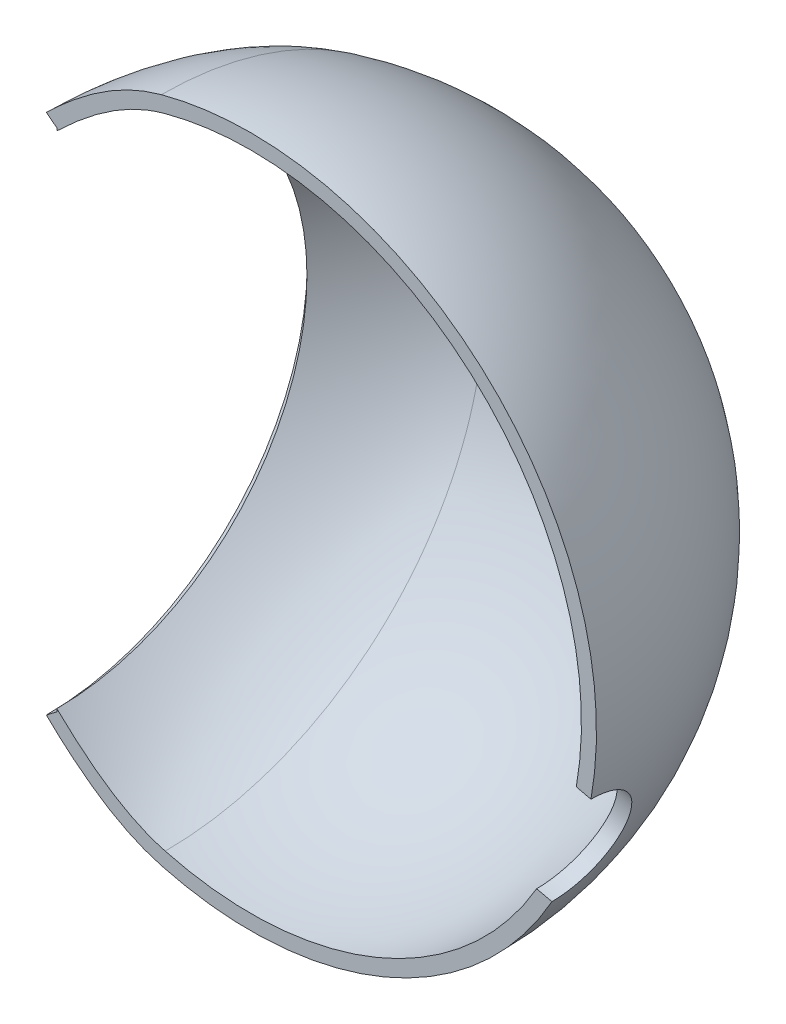
ISO-10303-21;
HEADER;
FILE_DESCRIPTION(('STEP AP214'),'2;1');
FILE_NAME('part.step','',(''),(''),'','','');
FILE_SCHEMA(('AUTOMOTIVE_DESIGN { 1 0 10303 214 1 1 1 1 }'));
ENDSEC;
DATA;
#1=APPLICATION_CONTEXT('core data for automotive mechanical design processes');
#2=APPLICATION_PROTOCOL_DEFINITION('international standard','automotive_design',2000,#1);
#3=PRODUCT_CONTEXT('',#1,'mechanical');
#4=PRODUCT('Part','Part','',(#3));
#5=PRODUCT_RELATED_PRODUCT_CATEGORY('part','',(#4));
#6=PRODUCT_DEFINITION_FORMATION('','',#4);
#7=PRODUCT_DEFINITION_CONTEXT('part definition',#1,'design');
#8=PRODUCT_DEFINITION('design','',#6,#7);
#9=PRODUCT_DEFINITION_SHAPE('','',#8);
#10=(LENGTH_UNIT() NAMED_UNIT(*) SI_UNIT(.MILLI.,.METRE.));
#11=(NAMED_UNIT(*) PLANE_ANGLE_UNIT() SI_UNIT($,.RADIAN.));
#12=(NAMED_UNIT(*) SI_UNIT($,.STERADIAN.) SOLID_ANGLE_UNIT());
#13=UNCERTAINTY_MEASURE_WITH_UNIT(LENGTH_MEASURE(1.E-05),#10,'distance_accuracy_value','');
#14=(GEOMETRIC_REPRESENTATION_CONTEXT(3) GLOBAL_UNCERTAINTY_ASSIGNED_CONTEXT((#13)) GLOBAL_UNIT_ASSIGNED_CONTEXT((#10,
#11,#12)) REPRESENTATION_CONTEXT('',''));
#15=CARTESIAN_POINT('',(0.,0.,0.));
#16=DIRECTION('',(0.,0.,1.));
#17=DIRECTION('',(1.,0.,0.));
#18=AXIS2_PLACEMENT_3D('',#15,#16,#17);
#19=CARTESIAN_POINT('',(-6.80370320936501,0.,0.));
#20=DIRECTION('',(-1.,0.,0.));
#21=DIRECTION('',(0.,0.,1.));
#22=AXIS2_PLACEMENT_3D('',#19,#20,#21);
#23=CONICAL_SURFACE('',#22,8.68183081701681,0.65462054811976);
#24=DIRECTION('',(0.793279017623361,0.608858275954688,0.));
#25=VECTOR('',#24,1.);
#26=CARTESIAN_POINT('',(4.50781951059202,0.,0.));
#27=LINE('',#26,#25);
#28=CARTESIAN_POINT('',(-6.45373387807853,-8.41322201866174,0.));
#29=VERTEX_POINT('',#28);
#30=CARTESIAN_POINT('',(-6.80370320936501,-8.68183081701681,0.));
#31=VERTEX_POINT('',#30);
#32=EDGE_CURVE('E178',#29,#31,#27,.F.);
#33=ORIENTED_EDGE('',*,*,#32,.F.);
#34=CARTESIAN_POINT('',(-6.45373387807853,0.,0.));
#35=DIRECTION('',(-1.,0.,0.));
#36=DIRECTION('',(0.,0.,1.));
#37=AXIS2_PLACEMENT_3D('',#34,#35,#36);
#38=CIRCLE('',#37,8.41322201866174);
#39=CARTESIAN_POINT('',(-6.45373387807853,0.,-8.41322201866174));
#40=VERTEX_POINT('',#39);
#41=EDGE_CURVE('E175',#40,#29,#38,.T.);
#42=ORIENTED_EDGE('',*,*,#41,.F.);
#43=DIRECTION('',(-0.793279017623361,0.,-0.608858275954688));
#44=VECTOR('',#43,1.);
#45=CARTESIAN_POINT('',(-6.80370320936501,0.,-8.68183081701681));
#46=LINE('',#45,#44);
#47=CARTESIAN_POINT('',(-6.80370320936501,0.,-8.68183081701681));
#48=VERTEX_POINT('',#47);
#49=EDGE_CURVE('E187',#40,#48,#46,.T.);
#50=ORIENTED_EDGE('',*,*,#49,.T.);
#51=CARTESIAN_POINT('',(-6.80370320936501,0.,0.));
#52=DIRECTION('',(-1.,0.,0.));
#53=DIRECTION('',(0.,0.,1.));
#54=AXIS2_PLACEMENT_3D('',#51,#52,#53);
#55=CIRCLE('',#54,8.68183081701681);
#56=EDGE_CURVE('E267',#48,#31,#55,.T.);
#57=ORIENTED_EDGE('',*,*,#56,.T.);
#58=EDGE_LOOP('',(#33,#42,#50,#57));
#59=FACE_BOUND('',#58,.T.);
#60=ADVANCED_FACE('F46',(#59),#23,.F.);
#61=CARTESIAN_POINT('',(-6.45373387807853,0.,0.));
#62=DIRECTION('',(1.,0.,0.));
#63=DIRECTION('',(0.,0.,-1.));
#64=AXIS2_PLACEMENT_3D('',#61,#62,#63);
#65=CONICAL_SURFACE('',#64,8.41322201866174,1.5512061202161);
#66=CARTESIAN_POINT('',(-6.45550146267924,0.,0.));
#67=DIRECTION('',(-1.,0.,0.));
#68=DIRECTION('',(0.,0.,1.));
#69=AXIS2_PLACEMENT_3D('',#66,#67,#68);
#70=CIRCLE('',#69,8.32300558991455);
#71=CARTESIAN_POINT('',(-6.45550146267924,8.32300558991455,0.));
#72=VERTEX_POINT('',#71);
#73=CARTESIAN_POINT('',(-6.45550146267924,0.,-8.32300558991455));
#74=VERTEX_POINT('',#73);
#75=EDGE_CURVE('E265',#72,#74,#70,.T.);
#76=ORIENTED_EDGE('',*,*,#75,.F.);
#77=DIRECTION('',(-0.0195889535603576,-0.999808118039862,0.));
#78=VECTOR('',#77,1.);
#79=CARTESIAN_POINT('',(-6.61857172290384,0.,0.));
#80=LINE('',#79,#78);
#81=CARTESIAN_POINT('',(-6.45373387807853,8.41322201866174,0.));
#82=VERTEX_POINT('',#81);
#83=EDGE_CURVE('E64',#72,#82,#80,.F.);
#84=ORIENTED_EDGE('',*,*,#83,.T.);
#85=CARTESIAN_POINT('',(-6.45373387807853,0.,0.));
#86=DIRECTION('',(-1.,0.,0.));
#87=DIRECTION('',(0.,0.,1.));
#88=AXIS2_PLACEMENT_3D('',#85,#86,#87);
#89=CIRCLE('',#88,8.41322201866174);
#90=EDGE_CURVE('E192',#82,#40,#89,.T.);
#91=ORIENTED_EDGE('',*,*,#90,.T.);
#92=DIRECTION('',(0.0195889535603576,0.,-0.999808118039862));
#93=VECTOR('',#92,1.);
#94=CARTESIAN_POINT('',(-6.45373387807853,0.,-8.41322201866174));
#95=LINE('',#94,#93);
#96=EDGE_CURVE('E272',#74,#40,#95,.T.);
#97=ORIENTED_EDGE('',*,*,#96,.F.);
#98=EDGE_LOOP('',(#76,#84,#91,#97));
#99=FACE_BOUND('',#98,.T.);
#100=ADVANCED_FACE('F207',(#99),#65,.T.);
#101=CARTESIAN_POINT('',(-6.45373387807853,0.,0.));
#102=DIRECTION('',(1.,0.,0.));
#103=DIRECTION('',(0.,0.,-1.));
#104=AXIS2_PLACEMENT_3D('',#101,#102,#103);
#105=CONICAL_SURFACE('',#104,8.41322201866174,1.5512061202161);
#106=ORIENTED_EDGE('',*,*,#41,.T.);
#107=DIRECTION('',(0.0195889535603576,-0.999808118039862,0.));
#108=VECTOR('',#107,1.);
#109=CARTESIAN_POINT('',(-6.61857172290384,0.,0.));
#110=LINE('',#109,#108);
#111=CARTESIAN_POINT('',(-6.45550146267924,-8.32300558991447,0.));
#112=VERTEX_POINT('',#111);
#113=EDGE_CURVE('E170',#29,#112,#110,.F.);
#114=ORIENTED_EDGE('',*,*,#113,.T.);
#115=CARTESIAN_POINT('',(-6.45550146267924,0.,0.));
#116=DIRECTION('',(-1.,0.,0.));
#117=DIRECTION('',(0.,0.,1.));
#118=AXIS2_PLACEMENT_3D('',#115,#116,#117);
#119=CIRCLE('',#118,8.32300558991455);
#120=EDGE_CURVE('E11',#74,#112,#119,.T.);
#121=ORIENTED_EDGE('',*,*,#120,.F.);
#122=ORIENTED_EDGE('',*,*,#96,.T.);
#123=EDGE_LOOP('',(#106,#114,#121,#122));
#124=FACE_BOUND('',#123,.T.);
#125=ADVANCED_FACE('F215',(#124),#105,.T.);
#126=CARTESIAN_POINT('',(-6.80370320936501,0.,0.));
#127=DIRECTION('',(-1.,0.,0.));
#128=DIRECTION('',(0.,0.,1.));
#129=AXIS2_PLACEMENT_3D('',#126,#127,#128);
#130=CONICAL_SURFACE('',#129,8.68183081701681,0.65462054811976);
#131=DIRECTION('',(-0.793279017623361,0.608858275954688,0.));
#132=VECTOR('',#131,1.);
#133=CARTESIAN_POINT('',(4.50781951059202,0.,0.));
#134=LINE('',#133,#132);
#135=CARTESIAN_POINT('',(-6.80370320936501,8.68183081701681,0.));
#136=VERTEX_POINT('',#135);
#137=EDGE_CURVE('E100',#136,#82,#134,.F.);
#138=ORIENTED_EDGE('',*,*,#137,.F.);
#139=CARTESIAN_POINT('',(-6.80370320936501,0.,0.));
#140=DIRECTION('',(-1.,0.,0.));
#141=DIRECTION('',(0.,0.,1.));
#142=AXIS2_PLACEMENT_3D('',#139,#140,#141);
#143=CIRCLE('',#142,8.68183081701681);
#144=EDGE_CURVE('E90',#136,#48,#143,.T.);
#145=ORIENTED_EDGE('',*,*,#144,.T.);
#146=ORIENTED_EDGE('',*,*,#49,.F.);
#147=ORIENTED_EDGE('',*,*,#90,.F.);
#148=EDGE_LOOP('',(#138,#145,#146,#147));
#149=FACE_BOUND('',#148,.T.);
#150=ADVANCED_FACE('F48',(#149),#130,.F.);
#151=CARTESIAN_POINT('',(-6.45550146267924,8.32300558991455,0.));
#152=CARTESIAN_POINT('',(-6.45550146267924,8.32300558991455,-16.6460111798291));
#153=CARTESIAN_POINT('',(-6.45550146267924,-8.32300558991455,-16.6460111798291));
#154=CARTESIAN_POINT('',(-6.45550146267924,-8.32300558991455,0.));
#155=CARTESIAN_POINT('',(-5.91999017324329,8.84266238176662,0.));
#156=CARTESIAN_POINT('',(-5.91999017324329,8.84266238176661,-17.6853247635332));
#157=CARTESIAN_POINT('',(-5.91999017324329,-8.84266238176661,-17.6853247635332));
#158=CARTESIAN_POINT('',(-5.91999017324329,-8.84266238176662,0.));
#159=CARTESIAN_POINT('',(-4.73611037690482,9.84639633856675,0.));
#160=CARTESIAN_POINT('',(-4.73611037690482,9.84639633856675,-19.6927926771335));
#161=CARTESIAN_POINT('',(-4.73611037690482,-9.84639633856675,-19.6927926771335));
#162=CARTESIAN_POINT('',(-4.73611037690482,-9.84639633856675,0.));
#163=CARTESIAN_POINT('',(-3.51528645360956,10.4461198181058,0.));
#164=CARTESIAN_POINT('',(-3.51528645360956,10.4461198181058,-20.8922396362115));
#165=CARTESIAN_POINT('',(-3.51528645360956,-10.4461198181058,-20.8922396362115));
#166=CARTESIAN_POINT('',(-3.51528645360956,-10.4461198181058,0.));
#167=CARTESIAN_POINT('',(-2.84700949613016,10.6251840891791,0.));
#168=CARTESIAN_POINT('',(-2.84700949613016,10.6251840891791,-21.2503681783582));
#169=CARTESIAN_POINT('',(-2.84700949613016,-10.6251840891791,-21.2503681783582));
#170=CARTESIAN_POINT('',(-2.84700949613016,-10.6251840891791,0.));
#171=(BOUNDED_SURFACE() B_SPLINE_SURFACE(3,3,((#151,#152,#153,#154),(#155,#156,#157,#158),(#159,
#160,#161,#162),(#163,#164,#165,#166),(#167,#168,#169,#170)),.UNSPECIFIED.,.F.,.F.,
.F.) B_SPLINE_SURFACE_WITH_KNOTS((4,1,4),(4,4),(0.,0.136304271179648,0.272608542359295),(0.,1.),
.UNSPECIFIED.) GEOMETRIC_REPRESENTATION_ITEM() RATIONAL_B_SPLINE_SURFACE(((1.,0.333333333333334,
0.333333333333334,1.),(1.,0.333333333333334,0.333333333333334,1.),(1.,0.333333333333334,
0.333333333333334,1.),(1.,0.333333333333334,0.333333333333334,1.),(1.,0.333333333333334,
0.333333333333334,1.))) REPRESENTATION_ITEM('') SURFACE());
#172=CARTESIAN_POINT('',(-6.45550146267924,-8.32300558991455,0.));
#173=CARTESIAN_POINT('',(-5.91999017324329,-8.84266238176662,0.));
#174=CARTESIAN_POINT('',(-4.73611037690482,-9.84639633856675,0.));
#175=CARTESIAN_POINT('',(-3.51528645360956,-10.4461198181058,0.));
#176=CARTESIAN_POINT('',(-2.84700949613016,-10.6251840891791,0.));
#177=(BOUNDED_CURVE() B_SPLINE_CURVE(3,(#172,#173,#174,#175,#176),.UNSPECIFIED.,.F.,
.F.) B_SPLINE_CURVE_WITH_KNOTS((4,1,4),(0.,0.136304271179648,0.272608542359295),
.UNSPECIFIED.) CURVE() GEOMETRIC_REPRESENTATION_ITEM() RATIONAL_B_SPLINE_CURVE((1.,1.,1.,1.,1.)) REPRESENTATION_ITEM(''));
#178=CARTESIAN_POINT('',(-2.84700949613016,-10.6251840891791,0.));
#179=VERTEX_POINT('',#178);
#180=EDGE_CURVE('E56',#112,#179,#177,.T.);
#181=CARTESIAN_POINT('',(-2.84700949613016,0.,0.));
#182=DIRECTION('',(-1.,0.,0.));
#183=DIRECTION('',(0.,0.,1.));
#184=AXIS2_PLACEMENT_3D('',#181,#182,#183);
#185=CIRCLE('',#184,10.6251840891791);
#186=CARTESIAN_POINT('',(-2.84700949613016,10.6251840891791,0.));
#187=VERTEX_POINT('',#186);
#188=EDGE_CURVE('E77',#187,#179,#185,.T.);
#189=CARTESIAN_POINT('',(-6.45550146267924,8.32300558991455,0.));
#190=CARTESIAN_POINT('',(-5.91999017324329,8.84266238176662,0.));
#191=CARTESIAN_POINT('',(-4.73611037690482,9.84639633856675,0.));
#192=CARTESIAN_POINT('',(-3.51528645360956,10.4461198181058,0.));
#193=CARTESIAN_POINT('',(-2.84700949613016,10.6251840891791,0.));
#194=(BOUNDED_CURVE() B_SPLINE_CURVE(3,(#189,#190,#191,#192,#193),.UNSPECIFIED.,.F.,
.F.) B_SPLINE_CURVE_WITH_KNOTS((4,1,4),(0.,0.136304271179648,0.272608542359295),
.UNSPECIFIED.) CURVE() GEOMETRIC_REPRESENTATION_ITEM() RATIONAL_B_SPLINE_CURVE((1.,1.,1.,1.,1.)) REPRESENTATION_ITEM(''));
#195=EDGE_CURVE('E252',#72,#187,#194,.T.);
#196=ORIENTED_EDGE('',*,*,#120,.T.);
#197=ORIENTED_EDGE('',*,*,#180,.T.);
#198=ORIENTED_EDGE('',*,*,#188,.F.);
#199=ORIENTED_EDGE('',*,*,#195,.F.);
#200=ORIENTED_EDGE('',*,*,#75,.T.);
#201=EDGE_LOOP('',(#196,#197,#198,#199,#200));
#202=FACE_BOUND('',#201,.T.);
#203=ADVANCED_FACE('F209',(#202),#171,.F.);
#204=CARTESIAN_POINT('',(-2.976419018679,11.1081470023243,0.));
#205=CARTESIAN_POINT('',(-2.97641901867899,11.1081470023243,-22.2162940046486));
#206=CARTESIAN_POINT('',(-2.97641901867899,-11.1081470023243,-22.2162940046486));
#207=CARTESIAN_POINT('',(-2.976419018679,-11.1081470023243,0.));
#208=CARTESIAN_POINT('',(-3.63608081291208,10.9313911572854,0.));
#209=CARTESIAN_POINT('',(-3.63608081291208,10.9313911572854,-21.8627823145708));
#210=CARTESIAN_POINT('',(-3.63608081291208,-10.9313911572854,-21.8627823145708));
#211=CARTESIAN_POINT('',(-3.63608081291208,-10.9313911572854,0.));
#212=CARTESIAN_POINT('',(-4.87193740120474,10.3462670900726,0.));
#213=CARTESIAN_POINT('',(-4.87193740120474,10.3462670900726,-20.6925341801452));
#214=CARTESIAN_POINT('',(-4.87193740120474,-10.3462670900726,-20.6925341801452));
#215=CARTESIAN_POINT('',(-4.87193740120474,-10.3462670900726,0.));
#216=CARTESIAN_POINT('',(-6.09705889057331,9.35541284183251,0.));
#217=CARTESIAN_POINT('',(-6.0970588905733,9.35541284183251,-18.710825683665));
#218=CARTESIAN_POINT('',(-6.0970588905733,-9.35541284183251,-18.710825683665));
#219=CARTESIAN_POINT('',(-6.09705889057331,-9.35541284183251,0.));
#220=CARTESIAN_POINT('',(-6.71088845271634,8.77189767392169,0.));
#221=CARTESIAN_POINT('',(-6.71088845271634,8.77189767392169,-17.5437953478434));
#222=CARTESIAN_POINT('',(-6.71088845271634,-8.77189767392169,-17.5437953478434));
#223=CARTESIAN_POINT('',(-6.71088845271634,-8.77189767392169,0.));
#224=CARTESIAN_POINT('',(-6.80370320936501,8.68183081701681,0.));
#225=CARTESIAN_POINT('',(-6.803703209365,8.6818308170168,-17.3636616340336));
#226=CARTESIAN_POINT('',(-6.803703209365,-8.6818308170168,-17.3636616340336));
#227=CARTESIAN_POINT('',(-6.80370320936501,-8.68183081701681,0.));
#228=(BOUNDED_SURFACE() B_SPLINE_SURFACE(3,3,((#204,#205,#206,#207),(#208,#209,#210,#211),(#212,
#213,#214,#215),(#216,#217,#218,#219),(#220,#221,#222,#223),(#224,#225,#226,#227)),
.UNSPECIFIED.,.F.,.F.,.F.) B_SPLINE_SURFACE_WITH_KNOTS((4,1,1,4),(4,4),(0.,0.125,0.25,
0.272608542359295),(0.,1.),
.UNSPECIFIED.) GEOMETRIC_REPRESENTATION_ITEM() RATIONAL_B_SPLINE_SURFACE(((1.,0.333333333333334,
0.333333333333334,1.),(1.,0.333333333333334,0.333333333333334,1.),(1.,0.333333333333334,
0.333333333333334,1.),(1.,0.333333333333334,0.333333333333334,1.),(1.,0.333333333333334,
0.333333333333334,1.),(1.,0.333333333333334,0.333333333333334,1.))) REPRESENTATION_ITEM('') SURFACE());
#229=CARTESIAN_POINT('',(-2.976419018679,0.,0.));
#230=DIRECTION('',(-1.,0.,0.));
#231=DIRECTION('',(0.,0.,1.));
#232=AXIS2_PLACEMENT_3D('',#229,#230,#231);
#233=CIRCLE('',#232,11.1081470023243);
#234=CARTESIAN_POINT('',(-2.976419018679,11.1081470023243,0.));
#235=VERTEX_POINT('',#234);
#236=CARTESIAN_POINT('',(-2.976419018679,-11.1081470023243,0.));
#237=VERTEX_POINT('',#236);
#238=EDGE_CURVE('E147',#235,#237,#233,.T.);
#239=CARTESIAN_POINT('',(-2.976419018679,-11.1081470023243,0.));
#240=CARTESIAN_POINT('',(-3.63608081291208,-10.9313911572854,0.));
#241=CARTESIAN_POINT('',(-4.87193740120474,-10.3462670900726,0.));
#242=CARTESIAN_POINT('',(-6.09705889057331,-9.35541284183251,0.));
#243=CARTESIAN_POINT('',(-6.71088845271634,-8.77189767392169,0.));
#244=CARTESIAN_POINT('',(-6.80370320936501,-8.68183081701681,0.));
#245=(BOUNDED_CURVE() B_SPLINE_CURVE(3,(#239,#240,#241,#242,#243,#244),.UNSPECIFIED.,.F.,
.F.) B_SPLINE_CURVE_WITH_KNOTS((4,1,1,4),(0.,0.125,0.25,0.272608542359295),
.UNSPECIFIED.) CURVE() GEOMETRIC_REPRESENTATION_ITEM() RATIONAL_B_SPLINE_CURVE((1.,1.,1.,1.,1.,1.)) REPRESENTATION_ITEM(''));
#246=EDGE_CURVE('E186',#237,#31,#245,.T.);
#247=CARTESIAN_POINT('',(-2.976419018679,11.1081470023243,0.));
#248=CARTESIAN_POINT('',(-3.63608081291208,10.9313911572854,0.));
#249=CARTESIAN_POINT('',(-4.87193740120474,10.3462670900726,0.));
#250=CARTESIAN_POINT('',(-6.09705889057331,9.35541284183251,0.));
#251=CARTESIAN_POINT('',(-6.71088845271634,8.77189767392169,0.));
#252=CARTESIAN_POINT('',(-6.80370320936501,8.68183081701681,0.));
#253=(BOUNDED_CURVE() B_SPLINE_CURVE(3,(#247,#248,#249,#250,#251,#252),.UNSPECIFIED.,.F.,
.F.) B_SPLINE_CURVE_WITH_KNOTS((4,1,1,4),(0.,0.125,0.25,0.272608542359295),
.UNSPECIFIED.) CURVE() GEOMETRIC_REPRESENTATION_ITEM() RATIONAL_B_SPLINE_CURVE((1.,1.,1.,1.,1.,1.)) REPRESENTATION_ITEM(''));
#254=EDGE_CURVE('E152',#235,#136,#253,.T.);
#255=ORIENTED_EDGE('',*,*,#238,.T.);
#256=ORIENTED_EDGE('',*,*,#246,.T.);
#257=ORIENTED_EDGE('',*,*,#56,.F.);
#258=ORIENTED_EDGE('',*,*,#144,.F.);
#259=ORIENTED_EDGE('',*,*,#254,.F.);
#260=EDGE_LOOP('',(#255,#256,#257,#258,#259));
#261=FACE_BOUND('',#260,.T.);
#262=ADVANCED_FACE('F214',(#261),#228,.F.);
#263=CARTESIAN_POINT('',(6.01695143432406,-2.77433184048614,0.));
#264=DIRECTION('',(0.974370064785235,-0.224951054343866,0.));
#265=DIRECTION('',(0.224951054343866,0.974370064785235,0.));
#266=AXIS2_PLACEMENT_3D('',#263,#264,#265);
#267=CYLINDRICAL_SURFACE('',#266,1.9);
#268=CARTESIAN_POINT('',(9.5086453426254,-5.53043070186837,-2.22369066106711E-13));
#269=CARTESIAN_POINT('',(9.50864462524465,-5.53043209028466,-0.0280510965341373));
#270=CARTESIAN_POINT('',(9.50885076183308,-5.52986409921521,-0.0561032733702905));
#271=CARTESIAN_POINT('',(9.50968434170283,-5.52758030343548,-0.111961716646305));
#272=CARTESIAN_POINT('',(9.51030888686742,-5.52587239469394,-0.139768350479469));
#273=CARTESIAN_POINT('',(9.51198239472775,-5.5213116151555,-0.195134425242829));
#274=CARTESIAN_POINT('',(9.51302921039203,-5.51846453704189,-0.222694406289802));
#275=CARTESIAN_POINT('',(9.51554799153365,-5.51163019427974,-0.277565422337399));
#276=CARTESIAN_POINT('',(9.51701861613647,-5.5076465260395,-0.304876966519076));
#277=CARTESIAN_POINT('',(9.52038475708987,-5.4985430240805,-0.359249823317197));
#278=CARTESIAN_POINT('',(9.52227976063192,-5.49342456169164,-0.386311397236591));
#279=CARTESIAN_POINT('',(9.52649310346573,-5.48205532578591,-0.440183377090189));
#280=CARTESIAN_POINT('',(9.52881175448377,-5.47580371851091,-0.466993582690472));
#281=CARTESIAN_POINT('',(9.53386959618845,-5.46217182843259,-0.520361805616304));
#282=CARTESIAN_POINT('',(9.53660989269636,-5.45478857794817,-0.54691895894667));
#283=CARTESIAN_POINT('',(9.54250726944915,-5.43889609383545,-0.59978178675983));
#284=CARTESIAN_POINT('',(9.54566619518155,-5.43038187402177,-0.626085759842199));
#285=CARTESIAN_POINT('',(9.55070455500348,-5.41679184852819,-0.665284823321979));
#286=CARTESIAN_POINT('',(9.55243834095331,-5.41211367639078,-0.678338097008748));
#287=CARTESIAN_POINT('',(9.55600831187515,-5.40247614277646,-0.70438152809006));
#288=CARTESIAN_POINT('',(9.55784484696714,-5.39751581876463,-0.71737128215711));
#289=CARTESIAN_POINT('',(9.56161611503238,-5.38732361659691,-0.743262442280261));
#290=CARTESIAN_POINT('',(9.563551051521,-5.3820911750921,-0.756163596937283));
#291=CARTESIAN_POINT('',(9.56750854865855,-5.37138517701149,-0.781791188486794));
#292=CARTESIAN_POINT('',(9.56953073672508,-5.36591264426129,-0.794518111571913));
#293=CARTESIAN_POINT('',(9.57571942166336,-5.34916090249019,-0.832376854290959));
#294=CARTESIAN_POINT('',(9.58002696945975,-5.33749635707117,-0.857316770525563));
#295=CARTESIAN_POINT('',(9.58899670116071,-5.31320763737066,-0.906496132680604));
#296=CARTESIAN_POINT('',(9.59365695954915,-5.3005886736692,-0.930738507716759));
#297=CARTESIAN_POINT('',(9.6033323834999,-5.27439661434628,-0.978524787225851));
#298=CARTESIAN_POINT('',(9.60834634935208,-5.26082674497341,-1.00207070150676));
#299=CARTESIAN_POINT('',(9.61872818560994,-5.23273835377446,-1.04846492283434));
#300=CARTESIAN_POINT('',(9.62409557329063,-5.2182211261407,-1.07131412151436));
#301=CARTESIAN_POINT('',(9.63518225209111,-5.1882427254469,-1.11631650329632));
#302=CARTESIAN_POINT('',(9.64090174469525,-5.17278101196539,-1.13846927672405));
#303=CARTESIAN_POINT('',(9.65268959138925,-5.14091772795332,-1.18208058550522));
#304=CARTESIAN_POINT('',(9.65875877698731,-5.12451391760916,-1.20353725911318));
#305=CARTESIAN_POINT('',(9.67124200635601,-5.09076974889152,-1.24575842402452));
#306=CARTESIAN_POINT('',(9.67765743869136,-5.07342561803117,-1.2665194884583));
#307=CARTESIAN_POINT('',(9.69082808357121,-5.0378035786103,-1.30735166927316));
#308=CARTESIAN_POINT('',(9.69758515275847,-5.01952055668609,-1.32741772223807));
#309=CARTESIAN_POINT('',(9.71139302690518,-4.98213137427579,-1.36674720898345));
#310=CARTESIAN_POINT('',(9.71844441494882,-4.96302357697111,-1.38600888200589));
#311=CARTESIAN_POINT('',(9.73277663417175,-4.92417185753104,-1.42350462997387));
#312=CARTESIAN_POINT('',(9.7400555992571,-4.90443308902441,-1.44174475430843));
#313=CARTESIAN_POINT('',(9.7548448843738,-4.86432401433446,-1.47720022762995));
#314=CARTESIAN_POINT('',(9.76235389282675,-4.84395728525671,-1.49442016893013));
#315=CARTESIAN_POINT('',(9.77760429640029,-4.80259584697864,-1.52783836356749));
#316=CARTESIAN_POINT('',(9.78534492043618,-4.78160322217196,-1.54403954796538));
#317=CARTESIAN_POINT('',(9.80105858953958,-4.73899275548764,-1.57542351087758));
#318=CARTESIAN_POINT('',(9.80903137087751,-4.71737562325167,-1.59060738491316));
#319=CARTESIAN_POINT('',(9.82520848073385,-4.67351790161736,-1.61996020579472));
#320=CARTESIAN_POINT('',(9.83341300083644,-4.65127679647395,-1.6341282764544));
#321=CARTESIAN_POINT('',(9.85005163691915,-4.60617233575332,-1.66145292032998));
#322=CARTESIAN_POINT('',(9.85848633084991,-4.58330741385588,-1.67460655380504));
#323=CARTESIAN_POINT('',(9.87558292959833,-4.53695426962471,-1.69990633920219));
#324=CARTESIAN_POINT('',(9.88424571838672,-4.51346361623396,-1.71204744700983));
#325=CARTESIAN_POINT('',(9.89738401768802,-4.47782317053571,-1.72947524096066));
#326=CARTESIAN_POINT('',(9.90179808370921,-4.46584679793813,-1.73516638740444));
#327=CARTESIAN_POINT('',(9.91068165287301,-4.44173742263289,-1.74629739146229));
#328=CARTESIAN_POINT('',(9.9151513017364,-4.42960400126612,-1.75173622796918));
#329=CARTESIAN_POINT('',(9.92412496438393,-4.40523576412143,-1.76233883618431));
#330=CARTESIAN_POINT('',(9.92862896564577,-4.39300098516276,-1.76750270311593));
#331=CARTESIAN_POINT('',(9.93765430215191,-4.36847801683942,-1.77753253280119));
#332=CARTESIAN_POINT('',(9.94217550327117,-4.35619021623884,-1.78239956906037));
#333=CARTESIAN_POINT('',(9.9557451006673,-4.31930367414272,-1.79653219637004));
#334=CARTESIAN_POINT('',(9.96484353097084,-4.29456216716573,-1.80538139315591));
#335=CARTESIAN_POINT('',(9.98311661301549,-4.24486438731737,-1.82188758397883));
#336=CARTESIAN_POINT('',(9.99229067099969,-4.21990976587007,-1.82955021948737));
#337=CARTESIAN_POINT('',(10.0107180964712,-4.16978439582904,-1.84368706233185));
#338=CARTESIAN_POINT('',(10.0199711485133,-4.14461450645707,-1.85016472292604));
#339=CARTESIAN_POINT('',(10.0385581293353,-4.09405774228884,-1.86193478922719));
#340=CARTESIAN_POINT('',(10.0478919709157,-4.06867110176611,-1.86722833904535));
#341=CARTESIAN_POINT('',(10.0666411874795,-4.01767880511729,-1.87663343779447));
#342=CARTESIAN_POINT('',(10.0760566372373,-3.99207294847227,-1.88074375027679));
#343=CARTESIAN_POINT('',(10.0949686397113,-3.94063950178697,-1.88778546750818));
#344=CARTESIAN_POINT('',(10.1044653521646,-3.91481147376832,-1.89071324037181));
#345=CARTESIAN_POINT('',(10.1235384287021,-3.86293014418189,-1.89539272552335));
#346=CARTESIAN_POINT('',(10.1331149532102,-3.83687636284825,-1.89713845207714));
#347=CARTESIAN_POINT('',(10.152345038666,-3.784539423837,-1.89945664906088));
#348=CARTESIAN_POINT('',(10.161998672257,-3.75825593090635,-1.9000208769837));
#349=CARTESIAN_POINT('',(10.1812879053647,-3.70570415786003,-1.89997794070606));
#350=CARTESIAN_POINT('',(10.1909235127755,-3.67943587997661,-1.89937159632826));
#351=CARTESIAN_POINT('',(10.2101047295829,-3.62712535307821,-1.89697001622575));
#352=CARTESIAN_POINT('',(10.2196505025213,-3.60108279094296,-1.89518297606336));
#353=CARTESIAN_POINT('',(10.2386565631869,-3.54922256337633,-1.89042204350986));
#354=CARTESIAN_POINT('',(10.2481170400315,-3.52340442332001,-1.88745408811222));
#355=CARTESIAN_POINT('',(10.266955947284,-3.47199121236265,-1.88033309169363));
#356=CARTESIAN_POINT('',(10.2763345387539,-3.44639570443702,-1.87618363582801));
#357=CARTESIAN_POINT('',(10.2950119117394,-3.39542548916148,-1.86670134361827));
#358=CARTESIAN_POINT('',(10.3043107639415,-3.3700505858976,-1.86136969978804));
#359=CARTESIAN_POINT('',(10.3228297638647,-3.3195187177554,-1.84952455611627));
#360=CARTESIAN_POINT('',(10.3320498229588,-3.294361997912,-1.84300987225067));
#361=CARTESIAN_POINT('',(10.3504110408564,-3.2442636321274,-1.82879996678079));
#362=CARTESIAN_POINT('',(10.3595518793339,-3.21932285957617,-1.82110125671564));
#363=CARTESIAN_POINT('',(10.3777537454797,-3.1696515868604,-1.80452433951219));
#364=CARTESIAN_POINT('',(10.3868141511829,-3.14492274651604,-1.79564046355189));
#365=CARTESIAN_POINT('',(10.400318038859,-3.10805322997268,-1.78145581019062));
#366=CARTESIAN_POINT('',(10.4048158726811,-3.09577065041239,-1.77657132858556));
#367=CARTESIAN_POINT('',(10.4137903745421,-3.0712560095483,-1.76650870173127));
#368=CARTESIAN_POINT('',(10.4182668921076,-3.05902433082174,-1.76132948769294));
#369=CARTESIAN_POINT('',(10.4271101730516,-3.03485668260855,-1.75077376429161));
#370=CARTESIAN_POINT('',(10.431477562622,-3.02291906689334,-1.74540155131349));
#371=CARTESIAN_POINT('',(10.4401705473704,-2.99915903779251,-1.73438011909532));
#372=CARTESIAN_POINT('',(10.4444961471152,-2.98733661181778,-1.72873093054245));
#373=CARTESIAN_POINT('',(10.4574147739453,-2.95202806150724,-1.7113647061614));
#374=CARTESIAN_POINT('',(10.4659430264662,-2.92871870894702,-1.69923689012999));
#375=CARTESIAN_POINT('',(10.4828321006334,-2.88255532929455,-1.67387958169066));
#376=CARTESIAN_POINT('',(10.4911924079216,-2.8597027018431,-1.66064720256776));
#377=CARTESIAN_POINT('',(10.5056660055165,-2.82013196414437,-1.63654277168297));
#378=CARTESIAN_POINT('',(10.5118241585013,-2.80329310834593,-1.62589522736983));
#379=CARTESIAN_POINT('',(10.5240442890898,-2.76986939920874,-1.60398067260016));
#380=CARTESIAN_POINT('',(10.5301057080485,-2.7532860329529,-1.59271108617737));
#381=CARTESIAN_POINT('',(10.5460730281488,-2.70958325463765,-1.56195872327627));
#382=CARTESIAN_POINT('',(10.5558640640244,-2.68276618895909,-1.54198331142985));
#383=CARTESIAN_POINT('',(10.5750010955059,-2.63033599790211,-1.50062786965537));
#384=CARTESIAN_POINT('',(10.5843492761054,-2.60471697193936,-1.47925633111975));
#385=CARTESIAN_POINT('',(10.600782829707,-2.55967683923005,-1.43952134928535));
#386=CARTESIAN_POINT('',(10.6079437798893,-2.54004929473612,-1.42142256320777));
#387=CARTESIAN_POINT('',(10.6219846245513,-2.50157000629153,-1.38432417623624));
#388=CARTESIAN_POINT('',(10.6288645909777,-2.48271806373645,-1.36532480866525));
#389=CARTESIAN_POINT('',(10.6424052338901,-2.44560258074623,-1.32627987017324));
#390=CARTESIAN_POINT('',(10.6490628596796,-2.42734726891632,-1.30622542726284));
#391=CARTESIAN_POINT('',(10.6620313311918,-2.39176994938322,-1.26542261490335));
#392=CARTESIAN_POINT('',(10.6683440310927,-2.37444296379628,-1.24467917720546));
#393=CARTESIAN_POINT('',(10.6806249339299,-2.34073190201044,-1.20249268624776));
#394=CARTESIAN_POINT('',(10.6865944852682,-2.32434413603057,-1.18105297595269));
#395=CARTESIAN_POINT('',(10.6981912712717,-2.29251170781412,-1.13747678844163));
#396=CARTESIAN_POINT('',(10.7038192878147,-2.27706489112227,-1.11534209346309));
#397=CARTESIAN_POINT('',(10.7147338059852,-2.24711649957259,-1.07037657835721));
#398=CARTESIAN_POINT('',(10.7200204721588,-2.23261446925458,-1.04754610155969));
#399=CARTESIAN_POINT('',(10.7302520623589,-2.20455669830186,-1.00119014945837));
#400=CARTESIAN_POINT('',(10.7351964879248,-2.1910023376338,-0.977663728830809));
#401=CARTESIAN_POINT('',(10.7447421721937,-2.16484087761004,-0.929917213211134));
#402=CARTESIAN_POINT('',(10.7493422319724,-2.15223708666295,-0.905695067237735));
#403=CARTESIAN_POINT('',(10.7581968429899,-2.12797678617466,-0.856556947037042));
#404=CARTESIAN_POINT('',(10.7624494683508,-2.11632555659376,-0.831638014427613));
#405=CARTESIAN_POINT('',(10.7685549905294,-2.09959085797336,-0.793811854495273));
#406=CARTESIAN_POINT('',(10.7705493029313,-2.09412340039024,-0.781095683574632));
#407=CARTESIAN_POINT('',(10.7744497766222,-2.08342608598379,-0.755489801798064));
#408=CARTESIAN_POINT('',(10.7763555575267,-2.07819725588488,-0.742599603111363));
#409=CARTESIAN_POINT('',(10.7800659069481,-2.06801120982903,-0.716732095226636));
#410=CARTESIAN_POINT('',(10.7818706942103,-2.06305340742916,-0.703755048327121));
#411=CARTESIAN_POINT('',(10.7853759769555,-2.05341970610022,-0.677736946975548));
#412=CARTESIAN_POINT('',(10.787076824419,-2.04874285678706,-0.66469629099555));
#413=CARTESIAN_POINT('',(10.7920165678457,-2.03515533833133,-0.625534335014605));
#414=CARTESIAN_POINT('',(10.7951095428978,-2.0266413310102,-0.599255404905757));
#415=CARTESIAN_POINT('',(10.8008821966104,-2.01074858533118,-0.546442402291322));
#416=CARTESIAN_POINT('',(10.8035636669838,-2.00336492574427,-0.519910003080968));
#417=CARTESIAN_POINT('',(10.8085158782954,-1.98973330219702,-0.466591023739833));
#418=CARTESIAN_POINT('',(10.8107876719267,-1.98348242725703,-0.439805286729283));
#419=CARTESIAN_POINT('',(10.814921824275,-1.97211666760979,-0.385981966093271));
#420=CARTESIAN_POINT('',(10.8167844639229,-1.96700100342616,-0.35894456864096));
#421=CARTESIAN_POINT('',(10.820100566729,-1.95790517774914,-0.304619776757071));
#422=CARTESIAN_POINT('',(10.8215535166026,-1.95392644058498,-0.27733211255867));
#423=CARTESIAN_POINT('',(10.8240494258754,-1.94710323986571,-0.222508558767039));
#424=CARTESIAN_POINT('',(10.8250910678276,-1.94426242072604,-0.194972155941902));
#425=CARTESIAN_POINT('',(10.8267623061499,-1.93971383320975,-0.139652931825139));
#426=CARTESIAN_POINT('',(10.8273897830305,-1.93801189243894,-0.111869569297159));
#427=CARTESIAN_POINT('',(10.8282300327975,-1.93573706475137,-0.0560573558605849));
#428=CARTESIAN_POINT('',(10.8284399023949,-1.93517208188721,-0.0280281377654323));
#429=CARTESIAN_POINT('',(10.8284395533151,-1.9351735943323,0.));
#430=B_SPLINE_CURVE_WITH_KNOTS('',3,(#268,#269,#270,#271,#272,#273,#274,#275,#276,#277,#278,
#279,#280,#281,#282,#283,#284,#285,#286,#287,#288,#289,#290,#291,#292,#293,#294,#295,#296,#297,
#298,#299,#300,#301,#302,#303,#304,#305,#306,#307,#308,#309,#310,#311,#312,#313,#314,#315,#316,
#317,#318,#319,#320,#321,#322,#323,#324,#325,#326,#327,#328,#329,#330,#331,#332,#333,#334,#335,
#336,#337,#338,#339,#340,#341,#342,#343,#344,#345,#346,#347,#348,#349,#350,#351,#352,#353,#354,
#355,#356,#357,#358,#359,#360,#361,#362,#363,#364,#365,#366,#367,#368,#369,#370,#371,#372,#373,
#374,#375,#376,#377,#378,#379,#380,#381,#382,#383,#384,#385,#386,#387,#388,#389,#390,#391,#392,
#393,#394,#395,#396,#397,#398,#399,#400,#401,#402,#403,#404,#405,#406,#407,#408,#409,#410,#411,
#412,#413,#414,#415,#416,#417,#418,#419,#420,#421,#422,#423,#424,#425,#426,#427,#428,#429),
.UNSPECIFIED.,.F.,.F.,(4,2,2,2,2,2,2,2,2,2,2,2,2,2,2,2,2,2,2,2,2,2,2,2,2,2,2,2,2,2,2,2,2,2,2,2,
2,2,2,2,2,2,2,2,2,2,2,2,2,2,2,2,2,2,2,2,2,2,2,2,2,2,2,2,2,2,2,2,2,2,2,2,2,2,2,2,2,2,2,2,4),(0.,
0.084148301369413,0.167719692168849,0.250871415521311,0.333762893230186,0.416554742372299,
0.499407758166103,0.582481892004949,0.665935254049707,0.70785528674839,0.749928076244396,
0.792091732008751,0.834090367690357,0.917664677379249,1.00081174489185,1.0836892238903,
1.16645576217329,1.24927011014647,1.33229022763037,1.41567241403464,1.4995704856229,
1.58364349087987,1.66715002037981,1.75024649322336,1.83309177784339,1.91584636436864,
1.99867149328612,2.08172826455143,2.16517675254401,2.20709980948586,2.24917989852023,
2.29124531894307,2.33314827962865,2.41654142032389,2.49952501820879,2.58226279241643,
2.6649202750852,2.74766382145792,2.83065959686737,2.91407257074104,2.99806554716919,
3.08199971957019,3.16535731600258,3.24830102678482,3.33099568668957,3.41360730608587,
3.49630206611848,3.57924530743793,3.66260054254439,3.70448539843252,3.74653324374806,
3.78793005250035,3.82932228506113,3.9121689964,3.99523944187539,4.05778722975385,
4.1206169583239,4.22509298105884,4.32898399566516,4.41188444276369,4.49476352814287,
4.57851048130252,4.66175081431836,4.74463785871508,4.82732737369508,4.9099767263599,
4.99274402637681,5.0757872386824,5.15926329902706,5.20121466809496,5.24333217756686,
5.28535462005629,5.32722581849668,5.41058582307822,5.49357189435985,5.5763415904104,
5.65905427674912,5.74187013479829,5.82494914664381,5.90845008522452,5.99252953852934),.UNSPECIFIED.);
#431=CARTESIAN_POINT('',(9.50864534262584,-5.53043070186737,0.));
#432=VERTEX_POINT('',#431);
#433=CARTESIAN_POINT('',(10.8284395533151,-1.9351735943323,0.));
#434=VERTEX_POINT('',#433);
#435=EDGE_CURVE('E248',#432,#434,#430,.T.);
#436=ORIENTED_EDGE('',*,*,#435,.F.);
#437=DIRECTION('',(0.974370064785235,-0.224951054343866,0.));
#438=VECTOR('',#437,1.);
#439=CARTESIAN_POINT('',(5.58954443107071,-4.62563496357809,0.));
#440=LINE('',#439,#438);
#441=CARTESIAN_POINT('',(10.0175360838913,-5.64791738678387,0.));
#442=VERTEX_POINT('',#441);
#443=EDGE_CURVE('E161',#432,#442,#440,.T.);
#444=ORIENTED_EDGE('',*,*,#443,.T.);
#445=CARTESIAN_POINT('',(11.3162087615036,-2.04778398911351,0.));
#446=CARTESIAN_POINT('',(11.3162093238276,-2.04778154911853,-0.0314807837130307));
#447=CARTESIAN_POINT('',(11.3159485455843,-2.04849602274108,-0.0629632063086241));
#448=CARTESIAN_POINT('',(11.3149043806819,-2.05137383032465,-0.125618560021385));
#449=CARTESIAN_POINT('',(11.3141248872986,-2.05352637117917,-0.156792053907673));
#450=CARTESIAN_POINT('',(11.3120487605128,-2.05927993221199,-0.21882795825643));
#451=CARTESIAN_POINT('',(11.310754782782,-2.06287351480652,-0.249691144447776));
#452=CARTESIAN_POINT('',(11.3076543350782,-2.07150401857082,-0.311104179945717));
#453=CARTESIAN_POINT('',(11.3058492558142,-2.07653702343643,-0.341654649575963));
#454=CARTESIAN_POINT('',(11.3017293365507,-2.08804124419277,-0.402440803233889));
#455=CARTESIAN_POINT('',(11.2994146264757,-2.09451209352513,-0.432676565438876));
#456=CARTESIAN_POINT('',(11.2942765303641,-2.1088857342422,-0.492832275943349));
#457=CARTESIAN_POINT('',(11.2914520420544,-2.11679162878372,-0.522751388159113));
#458=CARTESIAN_POINT('',(11.2852936866928,-2.13402862081736,-0.582273283728532));
#459=CARTESIAN_POINT('',(11.2819575373412,-2.14336610394286,-0.611873980198088));
#460=CARTESIAN_POINT('',(11.2747735343228,-2.16345827752891,-0.670758919322994));
#461=CARTESIAN_POINT('',(11.2709222914946,-2.17422234984834,-0.700039542277689));
#462=CARTESIAN_POINT('',(11.2627272742223,-2.1970953500134,-0.758116425897162));
#463=CARTESIAN_POINT('',(11.2583818843938,-2.20920868584248,-0.786910722759651));
#464=CARTESIAN_POINT('',(11.2492482210642,-2.23466025431825,-0.843615552804512));
#465=CARTESIAN_POINT('',(11.2444635332562,-2.2479885644968,-0.87153111195107));
#466=CARTESIAN_POINT('',(11.2344581537724,-2.2758636170011,-0.926479248176558));
#467=CARTESIAN_POINT('',(11.2292398713723,-2.29040362766544,-0.953515677370031));
#468=CARTESIAN_POINT('',(11.2183722511228,-2.32069571819028,-1.0067069703177));
#469=CARTESIAN_POINT('',(11.2127241805989,-2.33644423557905,-1.03286412129521));
#470=CARTESIAN_POINT('',(11.2010001245668,-2.36914644787852,-1.084298860611));
#471=CARTESIAN_POINT('',(11.1949243197993,-2.38609963377999,-1.10957681379131));
#472=CARTESIAN_POINT('',(11.1823460752577,-2.42120405508827,-1.15925568628274));
#473=CARTESIAN_POINT('',(11.1758428041502,-2.43935762542995,-1.18365474465898));
#474=CARTESIAN_POINT('',(11.1624090125499,-2.47685561802592,-1.23157881284275));
#475=CARTESIAN_POINT('',(11.1554767377801,-2.49620492936468,-1.25509950363749));
#476=CARTESIAN_POINT('',(11.1411825212533,-2.53608681111,-1.30127014290255));
#477=CARTESIAN_POINT('',(11.1338180013614,-2.5566264697228,-1.32391316433659));
#478=CARTESIAN_POINT('',(11.1187117202887,-2.59872375502254,-1.3681650383274));
#479=CARTESIAN_POINT('',(11.1109694419447,-2.62028277592537,-1.38977238801452));
#480=CARTESIAN_POINT('',(11.0951904119928,-2.66420607036365,-1.43168862148491));
#481=CARTESIAN_POINT('',(11.0871562295029,-2.68656329777339,-1.45200584919109));
#482=CARTESIAN_POINT('',(11.0707992232456,-2.73207957367903,-1.49134591537437));
#483=CARTESIAN_POINT('',(11.062478039513,-2.75523406532776,-1.51037470595447));
#484=CARTESIAN_POINT('',(11.0455508154631,-2.80234175729768,-1.5471424452287));
#485=CARTESIAN_POINT('',(11.0369455661832,-2.82629274081349,-1.56488459766195));
#486=CARTESIAN_POINT('',(11.0194520229097,-2.87499031027724,-1.59908394883421));
#487=CARTESIAN_POINT('',(11.0105637654921,-2.89973679341907,-1.61554131267744));
#488=CARTESIAN_POINT('',(10.9925040142539,-2.950022407388,-1.64717620156578));
#489=CARTESIAN_POINT('',(10.9833319071653,-2.97556325516519,-1.66235064637172));
#490=CARTESIAN_POINT('',(10.9647022314166,-3.02743485375685,-1.69142501368335));
#491=CARTESIAN_POINT('',(10.9552435081822,-3.0537687957353,-1.70531849987472));
#492=CARTESIAN_POINT('',(10.9360364502926,-3.10722388919465,-1.7318359869374));
#493=CARTESIAN_POINT('',(10.9262865266521,-3.13434932780079,-1.74445018341978));
#494=CARTESIAN_POINT('',(10.9065878217152,-3.189115103476,-1.76829735589399));
#495=CARTESIAN_POINT('',(10.8966391245532,-3.21675522237417,-1.77953090245146));
#496=CARTESIAN_POINT('',(10.8766365072038,-3.27230851532921,-1.80048587475031));
#497=CARTESIAN_POINT('',(10.866583894557,-3.30021819816295,-1.81021779001698));
#498=CARTESIAN_POINT('',(10.8463776596557,-3.35631282880298,-1.82817406025365));
#499=CARTESIAN_POINT('',(10.8362247822599,-3.38449573418747,-1.83640562896054));
#500=CARTESIAN_POINT('',(10.8158201029014,-3.44113912735427,-1.85136619610481));
#501=CARTESIAN_POINT('',(10.8055686063903,-3.46959875989827,-1.85809884749059));
#502=CARTESIAN_POINT('',(10.7849667628672,-3.52679786525598,-1.8700664831212));
#503=CARTESIAN_POINT('',(10.7746164097001,-3.55553735549664,-1.87530137347464));
#504=CARTESIAN_POINT('',(10.7538149019232,-3.61329838142019,-1.88427831637561));
#505=CARTESIAN_POINT('',(10.7433635551757,-3.64232045620553,-1.88801645143189));
#506=CARTESIAN_POINT('',(10.7223560972293,-3.70064884486095,-1.89400439371797));
#507=CARTESIAN_POINT('',(10.7117997235916,-3.72995585336105,-1.89624649744035));
#508=CARTESIAN_POINT('',(10.6905763272547,-3.78885589581907,-1.89924679256433));
#509=CARTESIAN_POINT('',(10.6799090711365,-3.818449417921,-1.89999364510929));
#510=CARTESIAN_POINT('',(10.6585690985948,-3.87761125712834,-1.90000628730518));
#511=CARTESIAN_POINT('',(10.6478963913113,-3.90717957730367,-1.89927311991801));
#512=CARTESIAN_POINT('',(10.6266475475613,-3.96602800994828,-1.89630095200713));
#513=CARTESIAN_POINT('',(10.6160712811712,-3.99530863535319,-1.8940731412903));
#514=CARTESIAN_POINT('',(10.5950187863377,-4.05358640794036,-1.88811494952522));
#515=CARTESIAN_POINT('',(10.5845423220555,-4.08258424058794,-1.88439212186538));
#516=CARTESIAN_POINT('',(10.5636909344089,-4.14030095964009,-1.87544685342221));
#517=CARTESIAN_POINT('',(10.5533158226451,-4.16902036224218,-1.87022818571415));
#518=CARTESIAN_POINT('',(10.5326667831795,-4.22618418024672,-1.85829407339037));
#519=CARTESIAN_POINT('',(10.522392858325,-4.25462858791039,-1.85157858677907));
#520=CARTESIAN_POINT('',(10.50194398846,-4.31124583777,-1.83665343990826));
#521=CARTESIAN_POINT('',(10.4917693637729,-4.33941779943533,-1.82844000239042));
#522=CARTESIAN_POINT('',(10.4715151409846,-4.39549294820766,-1.8105209795223));
#523=CARTESIAN_POINT('',(10.4614362820752,-4.42339406002559,-1.80080806950586));
#524=CARTESIAN_POINT('',(10.4413677828449,-4.47892957159807,-1.77989245357002));
#525=CARTESIAN_POINT('',(10.4313793706335,-4.50656042428077,-1.76867916514252));
#526=CARTESIAN_POINT('',(10.4115908318501,-4.56126350659022,-1.74488914897515));
#527=CARTESIAN_POINT('',(10.4017905376904,-4.58833623518882,-1.73231370807954));
#528=CARTESIAN_POINT('',(10.3824708672371,-4.64168721169364,-1.70587550583148));
#529=CARTESIAN_POINT('',(10.3729500004935,-4.66796970665705,-1.69202241518246));
#530=CARTESIAN_POINT('',(10.3541931763577,-4.71974313876702,-1.66303097924561));
#531=CARTESIAN_POINT('',(10.3449560942107,-4.74523720450042,-1.64789895170667));
#532=CARTESIAN_POINT('',(10.3267692218851,-4.79543599981279,-1.61635092680102));
#533=CARTESIAN_POINT('',(10.3178188291398,-4.82014238435807,-1.59993791106277));
#534=CARTESIAN_POINT('',(10.3002059877651,-4.86876728902351,-1.5658292930413));
#535=CARTESIAN_POINT('',(10.2915435941839,-4.89268565851471,-1.54813344759056));
#536=CARTESIAN_POINT('',(10.2745057540941,-4.93973520249443,-1.51146035272033));
#537=CARTESIAN_POINT('',(10.2661311259533,-4.96286413083952,-1.4924798421055));
#538=CARTESIAN_POINT('',(10.2496662093971,-5.00833461380959,-1.45323829006502));
#539=CARTESIAN_POINT('',(10.2415775730782,-5.03067159513735,-1.43297125831751));
#540=CARTESIAN_POINT('',(10.2256804568035,-5.07455700481201,-1.39115758695502));
#541=CARTESIAN_POINT('',(10.2178744944688,-5.09609837041112,-1.36960258431619));
#542=CARTESIAN_POINT('',(10.2025885237365,-5.13824871112823,-1.32536122713956));
#543=CARTESIAN_POINT('',(10.1951095300767,-5.15885479026167,-1.30267176259922));
#544=CARTESIAN_POINT('',(10.1805838217869,-5.19886073439494,-1.25640025396133));
#545=CARTESIAN_POINT('',(10.1735345481314,-5.21826775178786,-1.23282520322969));
#546=CARTESIAN_POINT('',(10.1598733541189,-5.25587591837015,-1.18478466529269));
#547=CARTESIAN_POINT('',(10.153259655485,-5.27408197117405,-1.16032352435677));
#548=CARTESIAN_POINT('',(10.1404728811496,-5.30928812276645,-1.11051270708994));
#549=CARTESIAN_POINT('',(10.1342989596806,-5.32629053595082,-1.08516488420284));
#550=CARTESIAN_POINT('',(10.1223932123494,-5.3590887781865,-1.03358266112476));
#551=CARTESIAN_POINT('',(10.1166615913531,-5.37488404807776,-1.00734785809493));
#552=CARTESIAN_POINT('',(10.105640153742,-5.40526678775732,-0.953993543900949));
#553=CARTESIAN_POINT('',(10.1003516697181,-5.41985061345676,-0.926871682854096));
#554=CARTESIAN_POINT('',(10.0902144611815,-5.44780863619039,-0.871744945277579));
#555=CARTESIAN_POINT('',(10.0853682283204,-5.46117597849023,-0.843736135779043));
#556=CARTESIAN_POINT('',(10.0761118233339,-5.4866983674221,-0.786837226961083));
#557=CARTESIAN_POINT('',(10.0717052865382,-5.49884331368335,-0.757942010884718));
#558=CARTESIAN_POINT('',(10.0633947253435,-5.52171963792582,-0.699775312484822));
#559=CARTESIAN_POINT('',(10.0594872546363,-5.53246072384239,-0.670508140063057));
#560=CARTESIAN_POINT('',(10.0521901290671,-5.55250678708152,-0.611649472143805));
#561=CARTESIAN_POINT('',(10.0487970983466,-5.56182113153164,-0.582061590581537));
#562=CARTESIAN_POINT('',(10.0425334228431,-5.57901538648492,-0.522564856407063));
#563=CARTESIAN_POINT('',(10.0396604655124,-5.58690164713187,-0.492658083889059));
#564=CARTESIAN_POINT('',(10.0344394402427,-5.60124146927501,-0.432526538283106));
#565=CARTESIAN_POINT('',(10.0320902479273,-5.60769809957642,-0.402302595118708));
#566=CARTESIAN_POINT('',(10.027917359638,-5.61918007792977,-0.341539573573135));
#567=CARTESIAN_POINT('',(10.0260938068174,-5.62420503607356,-0.311000411685934));
#568=CARTESIAN_POINT('',(10.022970767879,-5.63282504460692,-0.249609479108093));
#569=CARTESIAN_POINT('',(10.0216727212147,-5.63641616710398,-0.218757083925087));
#570=CARTESIAN_POINT('',(10.0195978376014,-5.64216861400364,-0.156742247009926));
#571=CARTESIAN_POINT('',(10.0188237146898,-5.64432249237692,-0.125579026756165));
#572=CARTESIAN_POINT('',(10.0177903238847,-5.64720340610932,-0.062943699310283));
#573=CARTESIAN_POINT('',(10.0175349594909,-5.64791962302934,-0.0314710279585771));
#574=CARTESIAN_POINT('',(10.0175360838913,-5.64791738678387,0.));
#575=B_SPLINE_CURVE_WITH_KNOTS('',3,(#445,#446,#447,#448,#449,#450,#451,#452,#453,#454,#455,
#456,#457,#458,#459,#460,#461,#462,#463,#464,#465,#466,#467,#468,#469,#470,#471,#472,#473,#474,
#475,#476,#477,#478,#479,#480,#481,#482,#483,#484,#485,#486,#487,#488,#489,#490,#491,#492,#493,
#494,#495,#496,#497,#498,#499,#500,#501,#502,#503,#504,#505,#506,#507,#508,#509,#510,#511,#512,
#513,#514,#515,#516,#517,#518,#519,#520,#521,#522,#523,#524,#525,#526,#527,#528,#529,#530,#531,
#532,#533,#534,#535,#536,#537,#538,#539,#540,#541,#542,#543,#544,#545,#546,#547,#548,#549,#550,
#551,#552,#553,#554,#555,#556,#557,#558,#559,#560,#561,#562,#563,#564,#565,#566,#567,#568,#569,
#570,#571,#572,#573,#574),.UNSPECIFIED.,.F.,.F.,(4,2,2,2,2,2,2,2,2,2,2,2,2,2,2,2,2,2,2,2,2,2,2,
2,2,2,2,2,2,2,2,2,2,2,2,2,2,2,2,2,2,2,2,2,2,2,2,2,2,2,2,2,2,2,2,2,2,2,2,2,2,2,2,2,4),(0.,
0.0944354550066036,0.188169990168683,0.281426839265098,0.374432335240585,0.467414147911092,
0.560599474065481,0.654213245232492,0.74847641728624,0.843057113005435,0.936924799051324,
1.03030192396186,1.12341364714471,1.2164862590761,1.30974556377858,1.4034152808002,
1.49771552282877,1.59214870028361,1.685890922414,1.7791654565786,1.87219913812139,
1.9652208444449,2.05845989949922,2.15214446554087,2.24649997997773,2.34081636911721,
2.43444077190913,2.52760241258492,2.62053446528363,2.71347234241505,2.80665190235986,
2.90030764291921,2.99467094792088,3.08896777883446,3.18256640948402,3.27569797745741,
3.36859666898373,3.46149796725543,3.55463685002853,3.64824600371052,3.74255411995582,
3.83677390650542,3.93033136971983,4.0234510275653,4.11636005814302,4.20928674642906,
4.30245888803876,4.39610220723442,4.49043884531249,4.58505003099634,4.67902775245777,
4.772594375488,4.86597590313332,4.95940042705241,5.05309650254029,5.14729150470148,
5.24221002428721,5.33643286683646,5.43000781288364,5.52315586275946,5.61610198227307,
5.70907339101479,5.80229776918805,5.89600144721859,5.99040764344672),.UNSPECIFIED.);
#576=CARTESIAN_POINT('',(11.3162087615036,-2.04778398911352,0.));
#577=VERTEX_POINT('',#576);
#578=EDGE_CURVE('E143',#577,#442,#575,.T.);
#579=ORIENTED_EDGE('',*,*,#578,.F.);
#580=DIRECTION('',(0.974370064785235,-0.224951054343866,0.));
#581=VECTOR('',#580,1.);
#582=CARTESIAN_POINT('',(6.4443584375774,-0.923028717394197,0.));
#583=LINE('',#582,#581);
#584=EDGE_CURVE('E159',#434,#577,#583,.T.);
#585=ORIENTED_EDGE('',*,*,#584,.F.);
#586=EDGE_LOOP('',(#436,#444,#579,#585));
#587=FACE_BOUND('',#586,.T.);
#588=ADVANCED_FACE('F158',(#587),#267,.F.);
#589=CARTESIAN_POINT('',(0.,0.,0.));
#590=DIRECTION('',(0.,0.,-1.));
#591=DIRECTION('',(0.,1.,0.));
#592=AXIS2_PLACEMENT_3D('',#589,#590,#591);
#593=SPHERICAL_SURFACE('',#592,11.5);
#594=CARTESIAN_POINT('',(0.,0.,0.));
#595=DIRECTION('',(0.,0.,1.));
#596=DIRECTION('',(1.,0.,0.));
#597=AXIS2_PLACEMENT_3D('',#594,#595,#596);
#598=CIRCLE('',#597,11.5);
#599=EDGE_CURVE('E139',#577,#235,#598,.T.);
#600=ORIENTED_EDGE('',*,*,#599,.F.);
#601=ORIENTED_EDGE('',*,*,#578,.T.);
#602=CARTESIAN_POINT('',(0.,0.,0.));
#603=DIRECTION('',(0.,0.,-1.));
#604=DIRECTION('',(0.,1.,0.));
#605=AXIS2_PLACEMENT_3D('',#602,#603,#604);
#606=CIRCLE('',#605,11.5);
#607=EDGE_CURVE('E164',#442,#237,#606,.T.);
#608=ORIENTED_EDGE('',*,*,#607,.T.);
#609=ORIENTED_EDGE('',*,*,#238,.F.);
#610=EDGE_LOOP('',(#600,#601,#608,#609));
#611=FACE_BOUND('',#610,.T.);
#612=ADVANCED_FACE('F141',(#611),#593,.T.);
#613=CARTESIAN_POINT('',(0.,0.,0.));
#614=DIRECTION('',(0.,0.,-1.));
#615=DIRECTION('',(0.,1.,0.));
#616=AXIS2_PLACEMENT_3D('',#613,#614,#615);
#617=SPHERICAL_SURFACE('',#616,11.);
#618=ORIENTED_EDGE('',*,*,#435,.T.);
#619=CARTESIAN_POINT('',(0.,0.,0.));
#620=DIRECTION('',(0.,0.,1.));
#621=DIRECTION('',(1.,0.,0.));
#622=AXIS2_PLACEMENT_3D('',#619,#620,#621);
#623=CIRCLE('',#622,11.);
#624=EDGE_CURVE('E153',#434,#187,#623,.T.);
#625=ORIENTED_EDGE('',*,*,#624,.T.);
#626=ORIENTED_EDGE('',*,*,#188,.T.);
#627=CARTESIAN_POINT('',(0.,0.,0.));
#628=DIRECTION('',(0.,0.,-1.));
#629=DIRECTION('',(0.,1.,0.));
#630=AXIS2_PLACEMENT_3D('',#627,#628,#629);
#631=CIRCLE('',#630,11.);
#632=EDGE_CURVE('E163',#432,#179,#631,.T.);
#633=ORIENTED_EDGE('',*,*,#632,.F.);
#634=EDGE_LOOP('',(#618,#625,#626,#633));
#635=FACE_BOUND('',#634,.T.);
#636=ADVANCED_FACE('F206',(#635),#617,.F.);
#637=CARTESIAN_POINT('',(0.,0.,0.));
#638=DIRECTION('',(0.,0.,1.));
#639=DIRECTION('',(1.,0.,0.));
#640=AXIS2_PLACEMENT_3D('',#637,#638,#639);
#641=PLANE('',#640);
#642=ORIENTED_EDGE('',*,*,#83,.F.);
#643=ORIENTED_EDGE('',*,*,#195,.T.);
#644=ORIENTED_EDGE('',*,*,#624,.F.);
#645=ORIENTED_EDGE('',*,*,#584,.T.);
#646=ORIENTED_EDGE('',*,*,#599,.T.);
#647=ORIENTED_EDGE('',*,*,#254,.T.);
#648=ORIENTED_EDGE('',*,*,#137,.T.);
#649=EDGE_LOOP('',(#642,#643,#644,#645,#646,#647,#648));
#650=FACE_BOUND('',#649,.T.);
#651=ADVANCED_FACE('F167',(#650),#641,.T.);
#652=ORIENTED_EDGE('',*,*,#632,.T.);
#653=ORIENTED_EDGE('',*,*,#180,.F.);
#654=ORIENTED_EDGE('',*,*,#113,.F.);
#655=ORIENTED_EDGE('',*,*,#32,.T.);
#656=ORIENTED_EDGE('',*,*,#246,.F.);
#657=ORIENTED_EDGE('',*,*,#607,.F.);
#658=ORIENTED_EDGE('',*,*,#443,.F.);
#659=EDGE_LOOP('',(#652,#653,#654,#655,#656,#657,#658));
#660=FACE_BOUND('',#659,.T.);
#661=ADVANCED_FACE('F314',(#660),#641,.T.);
#662=CLOSED_SHELL('',(#60,#100,#125,#150,#203,#262,#588,#612,#636,#651,#661));
#663=MANIFOLD_SOLID_BREP('B2',#662);
#664=ADVANCED_BREP_SHAPE_REPRESENTATION('',(#18,#663),#14);
#665=SHAPE_DEFINITION_REPRESENTATION(#9,#664);
ENDSEC;
END-ISO-10303-21;
